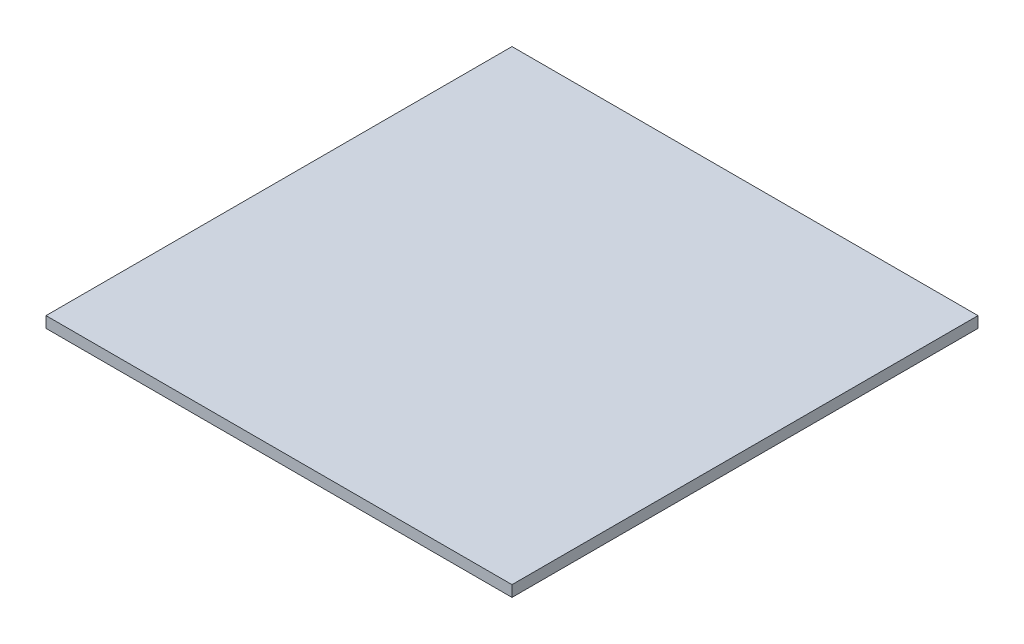
ISO-10303-21;
HEADER;
FILE_DESCRIPTION(('STEP AP214'),'2;1');
FILE_NAME('part.step','',(''),(''),'','','');
FILE_SCHEMA(('AUTOMOTIVE_DESIGN { 1 0 10303 214 1 1 1 1 }'));
ENDSEC;
DATA;
#1=APPLICATION_CONTEXT('core data for automotive mechanical design processes');
#2=APPLICATION_PROTOCOL_DEFINITION('international standard','automotive_design',2000,#1);
#3=PRODUCT_CONTEXT('',#1,'mechanical');
#4=PRODUCT('Part','Part','',(#3));
#5=PRODUCT_RELATED_PRODUCT_CATEGORY('part','',(#4));
#6=PRODUCT_DEFINITION_FORMATION('','',#4);
#7=PRODUCT_DEFINITION_CONTEXT('part definition',#1,'design');
#8=PRODUCT_DEFINITION('design','',#6,#7);
#9=PRODUCT_DEFINITION_SHAPE('','',#8);
#10=(LENGTH_UNIT() NAMED_UNIT(*) SI_UNIT(.MILLI.,.METRE.));
#11=(NAMED_UNIT(*) PLANE_ANGLE_UNIT() SI_UNIT($,.RADIAN.));
#12=(NAMED_UNIT(*) SI_UNIT($,.STERADIAN.) SOLID_ANGLE_UNIT());
#13=UNCERTAINTY_MEASURE_WITH_UNIT(LENGTH_MEASURE(1.E-05),#10,'distance_accuracy_value','');
#14=(GEOMETRIC_REPRESENTATION_CONTEXT(3) GLOBAL_UNCERTAINTY_ASSIGNED_CONTEXT((#13)) GLOBAL_UNIT_ASSIGNED_CONTEXT((#10,
#11,#12)) REPRESENTATION_CONTEXT('',''));
#15=CARTESIAN_POINT('',(0.,0.,0.));
#16=DIRECTION('',(0.,0.,1.));
#17=DIRECTION('',(1.,0.,0.));
#18=AXIS2_PLACEMENT_3D('',#15,#16,#17);
#19=CARTESIAN_POINT('',(0.,10.,0.));
#20=DIRECTION('',(1.,0.,0.));
#21=DIRECTION('',(0.,0.,-1.));
#22=AXIS2_PLACEMENT_3D('',#19,#20,#21);
#23=PLANE('',#22);
#24=DIRECTION('',(0.,0.,1.));
#25=VECTOR('',#24,1.);
#26=CARTESIAN_POINT('',(0.,0.,0.));
#27=LINE('',#26,#25);
#28=CARTESIAN_POINT('',(0.,0.,-420.));
#29=VERTEX_POINT('',#28);
#30=CARTESIAN_POINT('',(0.,0.,0.));
#31=VERTEX_POINT('',#30);
#32=EDGE_CURVE('E102',#29,#31,#27,.T.);
#33=ORIENTED_EDGE('',*,*,#32,.T.);
#34=DIRECTION('',(0.,-1.,0.));
#35=VECTOR('',#34,1.);
#36=CARTESIAN_POINT('',(0.,10.,0.));
#37=LINE('',#36,#35);
#38=CARTESIAN_POINT('',(0.,10.,0.));
#39=VERTEX_POINT('',#38);
#40=EDGE_CURVE('E11',#39,#31,#37,.T.);
#41=ORIENTED_EDGE('',*,*,#40,.F.);
#42=DIRECTION('',(0.,0.,1.));
#43=VECTOR('',#42,1.);
#44=CARTESIAN_POINT('',(0.,10.,0.));
#45=LINE('',#44,#43);
#46=CARTESIAN_POINT('',(0.,10.,-420.));
#47=VERTEX_POINT('',#46);
#48=EDGE_CURVE('E90',#47,#39,#45,.T.);
#49=ORIENTED_EDGE('',*,*,#48,.F.);
#50=DIRECTION('',(0.,-1.,0.));
#51=VECTOR('',#50,1.);
#52=CARTESIAN_POINT('',(0.,10.,-420.));
#53=LINE('',#52,#51);
#54=EDGE_CURVE('E98',#47,#29,#53,.T.);
#55=ORIENTED_EDGE('',*,*,#54,.T.);
#56=EDGE_LOOP('',(#33,#41,#49,#55));
#57=FACE_BOUND('',#56,.T.);
#58=ADVANCED_FACE('F39',(#57),#23,.F.);
#59=CARTESIAN_POINT('',(0.,10.,0.));
#60=DIRECTION('',(0.,0.,-1.));
#61=DIRECTION('',(-1.,0.,0.));
#62=AXIS2_PLACEMENT_3D('',#59,#60,#61);
#63=PLANE('',#62);
#64=DIRECTION('',(1.,0.,0.));
#65=VECTOR('',#64,1.);
#66=CARTESIAN_POINT('',(0.,0.,0.));
#67=LINE('',#66,#65);
#68=CARTESIAN_POINT('',(420.,0.,0.));
#69=VERTEX_POINT('',#68);
#70=EDGE_CURVE('E94',#31,#69,#67,.T.);
#71=ORIENTED_EDGE('',*,*,#70,.T.);
#72=DIRECTION('',(0.,-1.,0.));
#73=VECTOR('',#72,1.);
#74=CARTESIAN_POINT('',(420.,10.,0.));
#75=LINE('',#74,#73);
#76=CARTESIAN_POINT('',(420.,10.,0.));
#77=VERTEX_POINT('',#76);
#78=EDGE_CURVE('E47',#77,#69,#75,.T.);
#79=ORIENTED_EDGE('',*,*,#78,.F.);
#80=DIRECTION('',(1.,0.,0.));
#81=VECTOR('',#80,1.);
#82=CARTESIAN_POINT('',(0.,10.,0.));
#83=LINE('',#82,#81);
#84=EDGE_CURVE('E85',#39,#77,#83,.T.);
#85=ORIENTED_EDGE('',*,*,#84,.F.);
#86=ORIENTED_EDGE('',*,*,#40,.T.);
#87=EDGE_LOOP('',(#71,#79,#85,#86));
#88=FACE_BOUND('',#87,.T.);
#89=ADVANCED_FACE('F93',(#88),#63,.F.);
#90=CARTESIAN_POINT('',(420.,10.,0.));
#91=DIRECTION('',(-1.,0.,0.));
#92=DIRECTION('',(0.,0.,1.));
#93=AXIS2_PLACEMENT_3D('',#90,#91,#92);
#94=PLANE('',#93);
#95=DIRECTION('',(0.,0.,-1.));
#96=VECTOR('',#95,1.);
#97=CARTESIAN_POINT('',(420.,0.,0.));
#98=LINE('',#97,#96);
#99=CARTESIAN_POINT('',(420.,0.,-420.));
#100=VERTEX_POINT('',#99);
#101=EDGE_CURVE('E72',#69,#100,#98,.T.);
#102=ORIENTED_EDGE('',*,*,#101,.T.);
#103=DIRECTION('',(0.,-1.,0.));
#104=VECTOR('',#103,1.);
#105=CARTESIAN_POINT('',(420.,10.,-420.));
#106=LINE('',#105,#104);
#107=CARTESIAN_POINT('',(420.,10.,-420.));
#108=VERTEX_POINT('',#107);
#109=EDGE_CURVE('E95',#108,#100,#106,.T.);
#110=ORIENTED_EDGE('',*,*,#109,.F.);
#111=DIRECTION('',(0.,0.,-1.));
#112=VECTOR('',#111,1.);
#113=CARTESIAN_POINT('',(420.,10.,0.));
#114=LINE('',#113,#112);
#115=EDGE_CURVE('E88',#77,#108,#114,.T.);
#116=ORIENTED_EDGE('',*,*,#115,.F.);
#117=ORIENTED_EDGE('',*,*,#78,.T.);
#118=EDGE_LOOP('',(#102,#110,#116,#117));
#119=FACE_BOUND('',#118,.T.);
#120=ADVANCED_FACE('F96',(#119),#94,.F.);
#121=CARTESIAN_POINT('',(0.,10.,-420.));
#122=DIRECTION('',(0.,0.,1.));
#123=DIRECTION('',(1.,0.,0.));
#124=AXIS2_PLACEMENT_3D('',#121,#122,#123);
#125=PLANE('',#124);
#126=DIRECTION('',(-1.,0.,0.));
#127=VECTOR('',#126,1.);
#128=CARTESIAN_POINT('',(0.,0.,-420.));
#129=LINE('',#128,#127);
#130=EDGE_CURVE('E78',#100,#29,#129,.T.);
#131=ORIENTED_EDGE('',*,*,#130,.T.);
#132=ORIENTED_EDGE('',*,*,#54,.F.);
#133=DIRECTION('',(-1.,0.,0.));
#134=VECTOR('',#133,1.);
#135=CARTESIAN_POINT('',(0.,10.,-420.));
#136=LINE('',#135,#134);
#137=EDGE_CURVE('E55',#108,#47,#136,.T.);
#138=ORIENTED_EDGE('',*,*,#137,.F.);
#139=ORIENTED_EDGE('',*,*,#109,.T.);
#140=EDGE_LOOP('',(#131,#132,#138,#139));
#141=FACE_BOUND('',#140,.T.);
#142=ADVANCED_FACE('F109',(#141),#125,.F.);
#143=CARTESIAN_POINT('',(0.,10.,0.));
#144=DIRECTION('',(0.,-1.,0.));
#145=DIRECTION('',(0.,0.,-1.));
#146=AXIS2_PLACEMENT_3D('',#143,#144,#145);
#147=PLANE('',#146);
#148=ORIENTED_EDGE('',*,*,#48,.T.);
#149=ORIENTED_EDGE('',*,*,#84,.T.);
#150=ORIENTED_EDGE('',*,*,#115,.T.);
#151=ORIENTED_EDGE('',*,*,#137,.T.);
#152=EDGE_LOOP('',(#148,#149,#150,#151));
#153=FACE_BOUND('',#152,.T.);
#154=ADVANCED_FACE('F86',(#153),#147,.F.);
#155=CARTESIAN_POINT('',(0.,0.,0.));
#156=DIRECTION('',(0.,-1.,0.));
#157=DIRECTION('',(0.,0.,-1.));
#158=AXIS2_PLACEMENT_3D('',#155,#156,#157);
#159=PLANE('',#158);
#160=ORIENTED_EDGE('',*,*,#32,.F.);
#161=ORIENTED_EDGE('',*,*,#130,.F.);
#162=ORIENTED_EDGE('',*,*,#101,.F.);
#163=ORIENTED_EDGE('',*,*,#70,.F.);
#164=EDGE_LOOP('',(#160,#161,#162,#163));
#165=FACE_BOUND('',#164,.T.);
#166=ADVANCED_FACE('F112',(#165),#159,.T.);
#167=CLOSED_SHELL('',(#58,#89,#120,#142,#154,#166));
#168=MANIFOLD_SOLID_BREP('B2',#167);
#169=ADVANCED_BREP_SHAPE_REPRESENTATION('',(#18,#168),#14);
#170=SHAPE_DEFINITION_REPRESENTATION(#9,#169);
ENDSEC;
END-ISO-10303-21;
